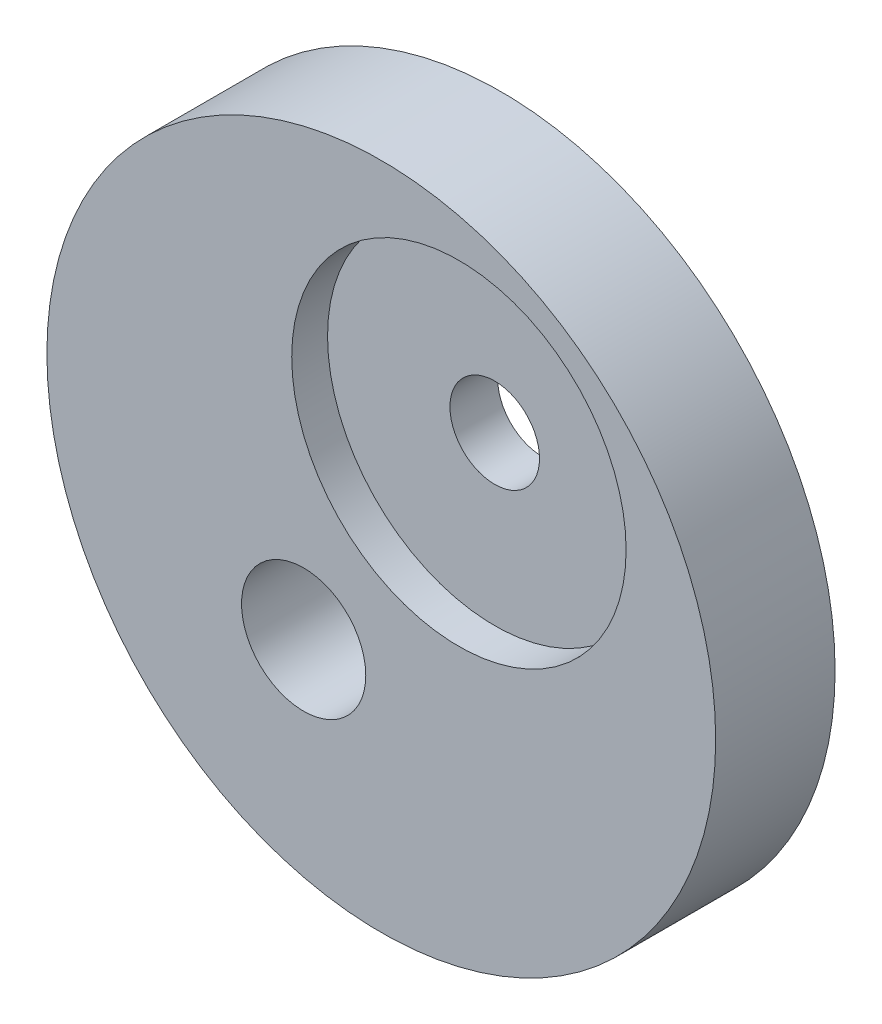
ISO-10303-21;
HEADER;
FILE_DESCRIPTION(('STEP AP214'),'2;1');
FILE_NAME('part.step','',(''),(''),'','','');
FILE_SCHEMA(('AUTOMOTIVE_DESIGN { 1 0 10303 214 1 1 1 1 }'));
ENDSEC;
DATA;
#1=APPLICATION_CONTEXT('core data for automotive mechanical design processes');
#2=APPLICATION_PROTOCOL_DEFINITION('international standard','automotive_design',2000,#1);
#3=PRODUCT_CONTEXT('',#1,'mechanical');
#4=PRODUCT('Part','Part','',(#3));
#5=PRODUCT_RELATED_PRODUCT_CATEGORY('part','',(#4));
#6=PRODUCT_DEFINITION_FORMATION('','',#4);
#7=PRODUCT_DEFINITION_CONTEXT('part definition',#1,'design');
#8=PRODUCT_DEFINITION('design','',#6,#7);
#9=PRODUCT_DEFINITION_SHAPE('','',#8);
#10=(LENGTH_UNIT() NAMED_UNIT(*) SI_UNIT(.MILLI.,.METRE.));
#11=(NAMED_UNIT(*) PLANE_ANGLE_UNIT() SI_UNIT($,.RADIAN.));
#12=(NAMED_UNIT(*) SI_UNIT($,.STERADIAN.) SOLID_ANGLE_UNIT());
#13=UNCERTAINTY_MEASURE_WITH_UNIT(LENGTH_MEASURE(1.E-05),#10,'distance_accuracy_value','');
#14=(GEOMETRIC_REPRESENTATION_CONTEXT(3) GLOBAL_UNCERTAINTY_ASSIGNED_CONTEXT((#13)) GLOBAL_UNIT_ASSIGNED_CONTEXT((#10,
#11,#12)) REPRESENTATION_CONTEXT('',''));
#15=CARTESIAN_POINT('',(0.,0.,0.));
#16=DIRECTION('',(0.,0.,1.));
#17=DIRECTION('',(1.,0.,0.));
#18=AXIS2_PLACEMENT_3D('',#15,#16,#17);
#19=CARTESIAN_POINT('',(0.,0.,5.));
#20=DIRECTION('',(0.,0.,-1.));
#21=DIRECTION('',(-1.,0.,0.));
#22=AXIS2_PLACEMENT_3D('',#19,#20,#21);
#23=CYLINDRICAL_SURFACE('',#22,1.87459725464265);
#24=CARTESIAN_POINT('',(0.,0.,3.5));
#25=DIRECTION('',(0.,0.,1.));
#26=DIRECTION('',(1.,0.,0.));
#27=AXIS2_PLACEMENT_3D('',#24,#25,#26);
#28=CIRCLE('',#27,1.87459725464265);
#29=CARTESIAN_POINT('',(1.87459725464265,0.,3.5));
#30=VERTEX_POINT('',#29);
#31=EDGE_CURVE('E49',#30,#30,#28,.T.);
#32=ORIENTED_EDGE('',*,*,#31,.T.);
#33=EDGE_LOOP('',(#32));
#34=FACE_BOUND('',#33,.T.);
#35=CARTESIAN_POINT('',(0.,0.,1.5));
#36=DIRECTION('',(0.,0.,-1.));
#37=DIRECTION('',(-1.,0.,0.));
#38=AXIS2_PLACEMENT_3D('',#35,#36,#37);
#39=CIRCLE('',#38,1.87459725464265);
#40=CARTESIAN_POINT('',(-1.87459725464265,0.,1.5));
#41=VERTEX_POINT('',#40);
#42=EDGE_CURVE('E35',#41,#41,#39,.T.);
#43=ORIENTED_EDGE('',*,*,#42,.T.);
#44=EDGE_LOOP('',(#43));
#45=FACE_BOUND('',#44,.T.);
#46=ADVANCED_FACE('F31',(#34,#45),#23,.F.);
#47=CARTESIAN_POINT('',(-3.25,-5.,5.));
#48=DIRECTION('',(0.,0.,1.));
#49=DIRECTION('',(1.,0.,0.));
#50=AXIS2_PLACEMENT_3D('',#47,#48,#49);
#51=PLANE('',#50);
#52=CARTESIAN_POINT('',(0.,0.,5.));
#53=DIRECTION('',(0.,0.,1.));
#54=DIRECTION('',(1.,0.,0.));
#55=AXIS2_PLACEMENT_3D('',#52,#53,#54);
#56=CIRCLE('',#55,7.);
#57=CARTESIAN_POINT('',(7.,0.,5.));
#58=VERTEX_POINT('',#57);
#59=EDGE_CURVE('E56',#58,#58,#56,.T.);
#60=ORIENTED_EDGE('',*,*,#59,.F.);
#61=EDGE_LOOP('',(#60));
#62=FACE_BOUND('',#61,.T.);
#63=CARTESIAN_POINT('',(-3.25,-5.,5.));
#64=DIRECTION('',(0.,0.,1.));
#65=DIRECTION('',(1.,0.,0.));
#66=AXIS2_PLACEMENT_3D('',#63,#64,#65);
#67=CIRCLE('',#66,14.);
#68=CARTESIAN_POINT('',(10.75,-5.,5.));
#69=VERTEX_POINT('',#68);
#70=EDGE_CURVE('E10',#69,#69,#67,.T.);
#71=ORIENTED_EDGE('',*,*,#70,.T.);
#72=EDGE_LOOP('',(#71));
#73=FACE_BOUND('',#72,.T.);
#74=CARTESIAN_POINT('',(-6.5,-10.,5.));
#75=DIRECTION('',(0.,0.,1.));
#76=DIRECTION('',(1.,0.,0.));
#77=AXIS2_PLACEMENT_3D('',#74,#75,#76);
#78=CIRCLE('',#77,2.6);
#79=CARTESIAN_POINT('',(-3.9,-10.,5.));
#80=VERTEX_POINT('',#79);
#81=EDGE_CURVE('E44',#80,#80,#78,.T.);
#82=ORIENTED_EDGE('',*,*,#81,.F.);
#83=EDGE_LOOP('',(#82));
#84=FACE_BOUND('',#83,.T.);
#85=ADVANCED_FACE('F71',(#62,#73,#84),#51,.T.);
#86=CARTESIAN_POINT('',(-3.25,-5.,0.));
#87=DIRECTION('',(0.,0.,1.));
#88=DIRECTION('',(1.,0.,0.));
#89=AXIS2_PLACEMENT_3D('',#86,#87,#88);
#90=PLANE('',#89);
#91=CARTESIAN_POINT('',(0.,0.,0.));
#92=DIRECTION('',(0.,0.,-1.));
#93=DIRECTION('',(-1.,0.,0.));
#94=AXIS2_PLACEMENT_3D('',#91,#92,#93);
#95=CIRCLE('',#94,7.);
#96=CARTESIAN_POINT('',(-7.,0.,0.));
#97=VERTEX_POINT('',#96);
#98=EDGE_CURVE('E63',#97,#97,#95,.T.);
#99=ORIENTED_EDGE('',*,*,#98,.F.);
#100=EDGE_LOOP('',(#99));
#101=FACE_BOUND('',#100,.T.);
#102=CARTESIAN_POINT('',(-3.25,-5.,0.));
#103=DIRECTION('',(0.,0.,1.));
#104=DIRECTION('',(1.,0.,0.));
#105=AXIS2_PLACEMENT_3D('',#102,#103,#104);
#106=CIRCLE('',#105,14.);
#107=CARTESIAN_POINT('',(10.75,-5.,0.));
#108=VERTEX_POINT('',#107);
#109=EDGE_CURVE('E39',#108,#108,#106,.T.);
#110=ORIENTED_EDGE('',*,*,#109,.F.);
#111=EDGE_LOOP('',(#110));
#112=FACE_BOUND('',#111,.T.);
#113=CARTESIAN_POINT('',(-6.5,-10.,0.));
#114=DIRECTION('',(0.,0.,1.));
#115=DIRECTION('',(1.,0.,0.));
#116=AXIS2_PLACEMENT_3D('',#113,#114,#115);
#117=CIRCLE('',#116,2.6);
#118=CARTESIAN_POINT('',(-3.9,-10.,0.));
#119=VERTEX_POINT('',#118);
#120=EDGE_CURVE('E47',#119,#119,#117,.T.);
#121=ORIENTED_EDGE('',*,*,#120,.T.);
#122=EDGE_LOOP('',(#121));
#123=FACE_BOUND('',#122,.T.);
#124=ADVANCED_FACE('F73',(#101,#112,#123),#90,.F.);
#125=CARTESIAN_POINT('',(-3.25,-5.,5.));
#126=DIRECTION('',(0.,0.,-1.));
#127=DIRECTION('',(-1.,0.,0.));
#128=AXIS2_PLACEMENT_3D('',#125,#126,#127);
#129=CYLINDRICAL_SURFACE('',#128,14.);
#130=ORIENTED_EDGE('',*,*,#70,.F.);
#131=EDGE_LOOP('',(#130));
#132=FACE_BOUND('',#131,.T.);
#133=ORIENTED_EDGE('',*,*,#109,.T.);
#134=EDGE_LOOP('',(#133));
#135=FACE_BOUND('',#134,.T.);
#136=ADVANCED_FACE('F33',(#132,#135),#129,.T.);
#137=CARTESIAN_POINT('',(-6.5,-10.,5.));
#138=DIRECTION('',(0.,0.,-1.));
#139=DIRECTION('',(-1.,0.,0.));
#140=AXIS2_PLACEMENT_3D('',#137,#138,#139);
#141=CYLINDRICAL_SURFACE('',#140,2.6);
#142=ORIENTED_EDGE('',*,*,#81,.T.);
#143=EDGE_LOOP('',(#142));
#144=FACE_BOUND('',#143,.T.);
#145=ORIENTED_EDGE('',*,*,#120,.F.);
#146=EDGE_LOOP('',(#145));
#147=FACE_BOUND('',#146,.T.);
#148=ADVANCED_FACE('F68',(#144,#147),#141,.F.);
#149=CARTESIAN_POINT('',(0.,0.,3.5));
#150=DIRECTION('',(0.,0.,1.));
#151=DIRECTION('',(1.,0.,0.));
#152=AXIS2_PLACEMENT_3D('',#149,#150,#151);
#153=CYLINDRICAL_SURFACE('',#152,7.);
#154=CARTESIAN_POINT('',(0.,0.,3.5));
#155=DIRECTION('',(0.,0.,1.));
#156=DIRECTION('',(1.,0.,0.));
#157=AXIS2_PLACEMENT_3D('',#154,#155,#156);
#158=CIRCLE('',#157,7.);
#159=CARTESIAN_POINT('',(7.,0.,3.5));
#160=VERTEX_POINT('',#159);
#161=EDGE_CURVE('E51',#160,#160,#158,.T.);
#162=ORIENTED_EDGE('',*,*,#161,.F.);
#163=EDGE_LOOP('',(#162));
#164=FACE_BOUND('',#163,.T.);
#165=ORIENTED_EDGE('',*,*,#59,.T.);
#166=EDGE_LOOP('',(#165));
#167=FACE_BOUND('',#166,.T.);
#168=ADVANCED_FACE('F86',(#164,#167),#153,.F.);
#169=CARTESIAN_POINT('',(0.,0.,3.5));
#170=DIRECTION('',(0.,0.,1.));
#171=DIRECTION('',(1.,0.,0.));
#172=AXIS2_PLACEMENT_3D('',#169,#170,#171);
#173=PLANE('',#172);
#174=ORIENTED_EDGE('',*,*,#31,.F.);
#175=EDGE_LOOP('',(#174));
#176=FACE_BOUND('',#175,.T.);
#177=ORIENTED_EDGE('',*,*,#161,.T.);
#178=EDGE_LOOP('',(#177));
#179=FACE_BOUND('',#178,.T.);
#180=ADVANCED_FACE('F89',(#176,#179),#173,.T.);
#181=CARTESIAN_POINT('',(0.,0.,1.5));
#182=DIRECTION('',(0.,0.,-1.));
#183=DIRECTION('',(-1.,0.,0.));
#184=AXIS2_PLACEMENT_3D('',#181,#182,#183);
#185=CYLINDRICAL_SURFACE('',#184,7.);
#186=CARTESIAN_POINT('',(0.,0.,1.5));
#187=DIRECTION('',(0.,0.,-1.));
#188=DIRECTION('',(-1.,0.,0.));
#189=AXIS2_PLACEMENT_3D('',#186,#187,#188);
#190=CIRCLE('',#189,7.);
#191=CARTESIAN_POINT('',(-7.,0.,1.5));
#192=VERTEX_POINT('',#191);
#193=EDGE_CURVE('E108',#192,#192,#190,.T.);
#194=ORIENTED_EDGE('',*,*,#193,.F.);
#195=EDGE_LOOP('',(#194));
#196=FACE_BOUND('',#195,.T.);
#197=ORIENTED_EDGE('',*,*,#98,.T.);
#198=EDGE_LOOP('',(#197));
#199=FACE_BOUND('',#198,.T.);
#200=ADVANCED_FACE('F93',(#196,#199),#185,.F.);
#201=CARTESIAN_POINT('',(0.,0.,1.5));
#202=DIRECTION('',(0.,0.,-1.));
#203=DIRECTION('',(-1.,0.,0.));
#204=AXIS2_PLACEMENT_3D('',#201,#202,#203);
#205=PLANE('',#204);
#206=ORIENTED_EDGE('',*,*,#42,.F.);
#207=EDGE_LOOP('',(#206));
#208=FACE_BOUND('',#207,.T.);
#209=ORIENTED_EDGE('',*,*,#193,.T.);
#210=EDGE_LOOP('',(#209));
#211=FACE_BOUND('',#210,.T.);
#212=ADVANCED_FACE('F97',(#208,#211),#205,.T.);
#213=CLOSED_SHELL('',(#46,#85,#124,#136,#148,#168,#180,#200,#212));
#214=MANIFOLD_SOLID_BREP('B2',#213);
#215=ADVANCED_BREP_SHAPE_REPRESENTATION('',(#18,#214),#14);
#216=SHAPE_DEFINITION_REPRESENTATION(#9,#215);
ENDSEC;
END-ISO-10303-21;
